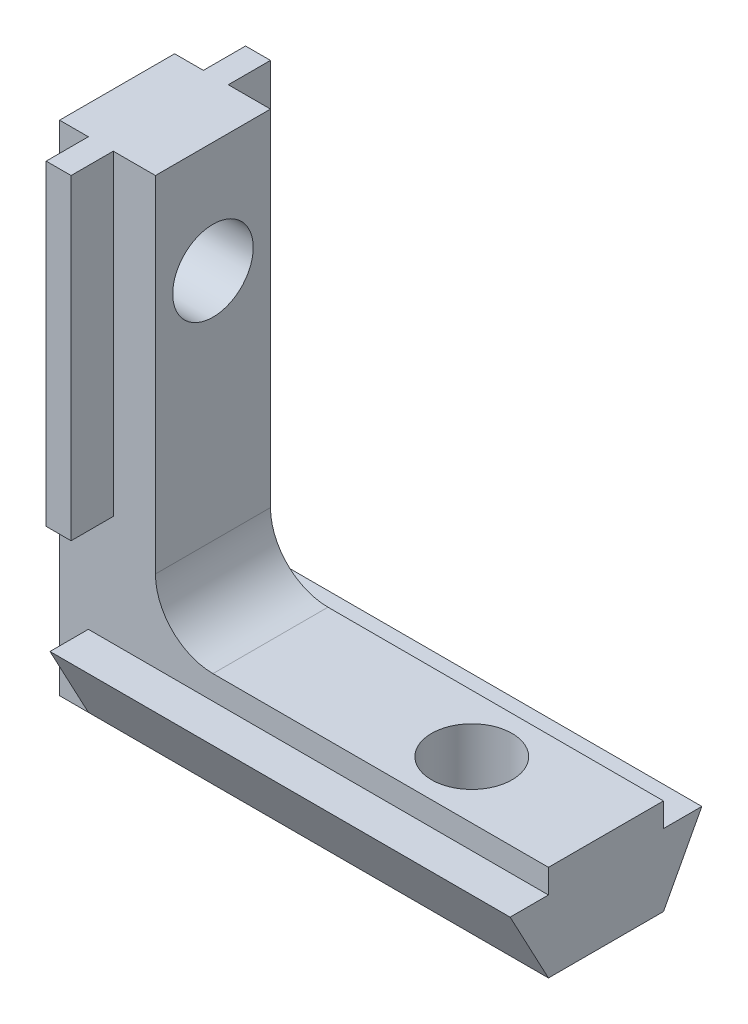
ISO-10303-21;
HEADER;
FILE_DESCRIPTION(('STEP AP214'),'2;1');
FILE_NAME('part.step','',(''),(''),'','','');
FILE_SCHEMA(('AUTOMOTIVE_DESIGN { 1 0 10303 214 1 1 1 1 }'));
ENDSEC;
DATA;
#1=APPLICATION_CONTEXT('core data for automotive mechanical design processes');
#2=APPLICATION_PROTOCOL_DEFINITION('international standard','automotive_design',2000,#1);
#3=PRODUCT_CONTEXT('',#1,'mechanical');
#4=PRODUCT('Part','Part','',(#3));
#5=PRODUCT_RELATED_PRODUCT_CATEGORY('part','',(#4));
#6=PRODUCT_DEFINITION_FORMATION('','',#4);
#7=PRODUCT_DEFINITION_CONTEXT('part definition',#1,'design');
#8=PRODUCT_DEFINITION('design','',#6,#7);
#9=PRODUCT_DEFINITION_SHAPE('','',#8);
#10=(LENGTH_UNIT() NAMED_UNIT(*) SI_UNIT(.MILLI.,.METRE.));
#11=(NAMED_UNIT(*) PLANE_ANGLE_UNIT() SI_UNIT($,.RADIAN.));
#12=(NAMED_UNIT(*) SI_UNIT($,.STERADIAN.) SOLID_ANGLE_UNIT());
#13=UNCERTAINTY_MEASURE_WITH_UNIT(LENGTH_MEASURE(1.E-05),#10,'distance_accuracy_value','');
#14=(GEOMETRIC_REPRESENTATION_CONTEXT(3) GLOBAL_UNCERTAINTY_ASSIGNED_CONTEXT((#13)) GLOBAL_UNIT_ASSIGNED_CONTEXT((#10,
#11,#12)) REPRESENTATION_CONTEXT('',''));
#15=CARTESIAN_POINT('',(0.,0.,0.));
#16=DIRECTION('',(0.,0.,1.));
#17=DIRECTION('',(1.,0.,0.));
#18=AXIS2_PLACEMENT_3D('',#15,#16,#17);
#19=CARTESIAN_POINT('',(5.,26.,3.));
#20=DIRECTION('',(0.,-1.,0.));
#21=DIRECTION('',(0.,0.,-1.));
#22=AXIS2_PLACEMENT_3D('',#19,#20,#21);
#23=PLANE('',#22);
#24=DIRECTION('',(-1.,0.,0.));
#25=VECTOR('',#24,1.);
#26=CARTESIAN_POINT('',(5.,26.,-3.));
#27=LINE('',#26,#25);
#28=CARTESIAN_POINT('',(5.,26.,-3.));
#29=VERTEX_POINT('',#28);
#30=CARTESIAN_POINT('',(2.8,26.,-3.));
#31=VERTEX_POINT('',#30);
#32=EDGE_CURVE('E277',#29,#31,#27,.T.);
#33=ORIENTED_EDGE('',*,*,#32,.T.);
#34=DIRECTION('',(0.,0.,-1.));
#35=VECTOR('',#34,1.);
#36=CARTESIAN_POINT('',(2.8,26.,-5.2));
#37=LINE('',#36,#35);
#38=CARTESIAN_POINT('',(2.8,26.,-5.2));
#39=VERTEX_POINT('',#38);
#40=EDGE_CURVE('E208',#31,#39,#37,.T.);
#41=ORIENTED_EDGE('',*,*,#40,.T.);
#42=DIRECTION('',(-1.,0.,0.));
#43=VECTOR('',#42,1.);
#44=CARTESIAN_POINT('',(1.5,26.,-5.2));
#45=LINE('',#44,#43);
#46=CARTESIAN_POINT('',(1.5,26.,-5.2));
#47=VERTEX_POINT('',#46);
#48=EDGE_CURVE('E181',#39,#47,#45,.T.);
#49=ORIENTED_EDGE('',*,*,#48,.T.);
#50=DIRECTION('',(0.,0.,1.));
#51=VECTOR('',#50,1.);
#52=CARTESIAN_POINT('',(1.5,26.,-5.2));
#53=LINE('',#52,#51);
#54=CARTESIAN_POINT('',(1.5,26.,-3.));
#55=VERTEX_POINT('',#54);
#56=EDGE_CURVE('E204',#47,#55,#53,.T.);
#57=ORIENTED_EDGE('',*,*,#56,.T.);
#58=CARTESIAN_POINT('',(0.,26.,-3.));
#59=VERTEX_POINT('',#58);
#60=EDGE_CURVE('E259',#55,#59,#27,.T.);
#61=ORIENTED_EDGE('',*,*,#60,.T.);
#62=DIRECTION('',(0.,0.,-1.));
#63=VECTOR('',#62,1.);
#64=CARTESIAN_POINT('',(0.,26.,3.));
#65=LINE('',#64,#63);
#66=CARTESIAN_POINT('',(0.,26.,3.));
#67=VERTEX_POINT('',#66);
#68=EDGE_CURVE('E310',#67,#59,#65,.T.);
#69=ORIENTED_EDGE('',*,*,#68,.F.);
#70=DIRECTION('',(-1.,0.,0.));
#71=VECTOR('',#70,1.);
#72=CARTESIAN_POINT('',(5.,26.,3.));
#73=LINE('',#72,#71);
#74=CARTESIAN_POINT('',(1.5,26.,3.));
#75=VERTEX_POINT('',#74);
#76=EDGE_CURVE('E263',#75,#67,#73,.T.);
#77=ORIENTED_EDGE('',*,*,#76,.F.);
#78=CARTESIAN_POINT('',(1.5,26.,5.2));
#79=VERTEX_POINT('',#78);
#80=EDGE_CURVE('E206',#75,#79,#53,.T.);
#81=ORIENTED_EDGE('',*,*,#80,.T.);
#82=DIRECTION('',(1.,0.,0.));
#83=VECTOR('',#82,1.);
#84=CARTESIAN_POINT('',(1.5,26.,5.2));
#85=LINE('',#84,#83);
#86=CARTESIAN_POINT('',(2.8,26.,5.2));
#87=VERTEX_POINT('',#86);
#88=EDGE_CURVE('E188',#79,#87,#85,.T.);
#89=ORIENTED_EDGE('',*,*,#88,.T.);
#90=CARTESIAN_POINT('',(2.8,26.,3.));
#91=VERTEX_POINT('',#90);
#92=EDGE_CURVE('E209',#87,#91,#37,.T.);
#93=ORIENTED_EDGE('',*,*,#92,.T.);
#94=CARTESIAN_POINT('',(5.,26.,3.));
#95=VERTEX_POINT('',#94);
#96=EDGE_CURVE('E260',#95,#91,#73,.T.);
#97=ORIENTED_EDGE('',*,*,#96,.F.);
#98=DIRECTION('',(0.,0.,-1.));
#99=VECTOR('',#98,1.);
#100=CARTESIAN_POINT('',(5.,26.,3.));
#101=LINE('',#100,#99);
#102=EDGE_CURVE('E276',#95,#29,#101,.T.);
#103=ORIENTED_EDGE('',*,*,#102,.T.);
#104=EDGE_LOOP('',(#33,#41,#49,#57,#61,#69,#77,#81,#89,#93,#97,#103));
#105=FACE_BOUND('',#104,.T.);
#106=ADVANCED_FACE('F36',(#105),#23,.F.);
#107=CARTESIAN_POINT('',(0.,26.,3.));
#108=DIRECTION('',(1.,0.,0.));
#109=DIRECTION('',(0.,1.,0.));
#110=AXIS2_PLACEMENT_3D('',#107,#108,#109);
#111=PLANE('',#110);
#112=CARTESIAN_POINT('',(0.,20.2,0.));
#113=DIRECTION('',(1.,0.,0.));
#114=DIRECTION('',(0.,0.,-1.));
#115=AXIS2_PLACEMENT_3D('',#112,#113,#114);
#116=CIRCLE('',#115,2.1);
#117=CARTESIAN_POINT('',(0.,20.2,-2.1));
#118=VERTEX_POINT('',#117);
#119=EDGE_CURVE('E402',#118,#118,#116,.T.);
#120=ORIENTED_EDGE('',*,*,#119,.T.);
#121=EDGE_LOOP('',(#120));
#122=FACE_BOUND('',#121,.T.);
#123=DIRECTION('',(0.,-1.,0.));
#124=VECTOR('',#123,1.);
#125=CARTESIAN_POINT('',(0.,26.,-3.));
#126=LINE('',#125,#124);
#127=CARTESIAN_POINT('',(0.,0.,-3.));
#128=VERTEX_POINT('',#127);
#129=EDGE_CURVE('E280',#59,#128,#126,.T.);
#130=ORIENTED_EDGE('',*,*,#129,.T.);
#131=DIRECTION('',(0.,0.,-1.));
#132=VECTOR('',#131,1.);
#133=CARTESIAN_POINT('',(0.,0.,3.));
#134=LINE('',#133,#132);
#135=CARTESIAN_POINT('',(0.,0.,3.));
#136=VERTEX_POINT('',#135);
#137=EDGE_CURVE('E307',#136,#128,#134,.T.);
#138=ORIENTED_EDGE('',*,*,#137,.F.);
#139=DIRECTION('',(0.,-1.,0.));
#140=VECTOR('',#139,1.);
#141=CARTESIAN_POINT('',(0.,26.,3.));
#142=LINE('',#141,#140);
#143=EDGE_CURVE('E262',#67,#136,#142,.T.);
#144=ORIENTED_EDGE('',*,*,#143,.F.);
#145=ORIENTED_EDGE('',*,*,#68,.T.);
#146=EDGE_LOOP('',(#130,#138,#144,#145));
#147=FACE_BOUND('',#146,.T.);
#148=ADVANCED_FACE('F423',(#122,#147),#111,.F.);
#149=CARTESIAN_POINT('',(0.,0.,3.));
#150=DIRECTION('',(0.,1.,0.));
#151=DIRECTION('',(0.,0.,1.));
#152=AXIS2_PLACEMENT_3D('',#149,#150,#151);
#153=PLANE('',#152);
#154=CARTESIAN_POINT('',(18.5,0.,0.));
#155=DIRECTION('',(0.,1.,0.));
#156=DIRECTION('',(0.,0.,1.));
#157=AXIS2_PLACEMENT_3D('',#154,#155,#156);
#158=CIRCLE('',#157,2.1);
#159=CARTESIAN_POINT('',(18.5,0.,2.1));
#160=VERTEX_POINT('',#159);
#161=EDGE_CURVE('E396',#160,#160,#158,.T.);
#162=ORIENTED_EDGE('',*,*,#161,.T.);
#163=EDGE_LOOP('',(#162));
#164=FACE_BOUND('',#163,.T.);
#165=DIRECTION('',(1.,0.,0.));
#166=VECTOR('',#165,1.);
#167=CARTESIAN_POINT('',(1.5,0.,3.));
#168=LINE('',#167,#166);
#169=CARTESIAN_POINT('',(1.49999999999999,0.,3.));
#170=VERTEX_POINT('',#169);
#171=CARTESIAN_POINT('',(25.5,0.,3.));
#172=VERTEX_POINT('',#171);
#173=EDGE_CURVE('E243',#170,#172,#168,.T.);
#174=ORIENTED_EDGE('',*,*,#173,.F.);
#175=DIRECTION('',(1.,0.,0.));
#176=VECTOR('',#175,1.);
#177=CARTESIAN_POINT('',(0.,0.,3.));
#178=LINE('',#177,#176);
#179=EDGE_CURVE('E265',#136,#170,#178,.T.);
#180=ORIENTED_EDGE('',*,*,#179,.F.);
#181=ORIENTED_EDGE('',*,*,#137,.T.);
#182=DIRECTION('',(1.,0.,0.));
#183=VECTOR('',#182,1.);
#184=CARTESIAN_POINT('',(0.,0.,-3.));
#185=LINE('',#184,#183);
#186=CARTESIAN_POINT('',(1.5,0.,-3.));
#187=VERTEX_POINT('',#186);
#188=EDGE_CURVE('E282',#128,#187,#185,.T.);
#189=ORIENTED_EDGE('',*,*,#188,.T.);
#190=DIRECTION('',(1.,0.,0.));
#191=VECTOR('',#190,1.);
#192=CARTESIAN_POINT('',(1.5,0.,-3.));
#193=LINE('',#192,#191);
#194=CARTESIAN_POINT('',(25.5,0.,-3.));
#195=VERTEX_POINT('',#194);
#196=EDGE_CURVE('E235',#187,#195,#193,.T.);
#197=ORIENTED_EDGE('',*,*,#196,.T.);
#198=DIRECTION('',(0.,0.,-1.));
#199=VECTOR('',#198,1.);
#200=CARTESIAN_POINT('',(25.5,0.,3.));
#201=LINE('',#200,#199);
#202=EDGE_CURVE('E304',#172,#195,#201,.T.);
#203=ORIENTED_EDGE('',*,*,#202,.F.);
#204=EDGE_LOOP('',(#174,#180,#181,#189,#197,#203));
#205=FACE_BOUND('',#204,.T.);
#206=ADVANCED_FACE('F374',(#164,#205),#153,.F.);
#207=CARTESIAN_POINT('',(25.5,0.,3.));
#208=DIRECTION('',(-1.,0.,0.));
#209=DIRECTION('',(0.,0.,1.));
#210=AXIS2_PLACEMENT_3D('',#207,#208,#209);
#211=PLANE('',#210);
#212=DIRECTION('',(0.,1.,0.));
#213=VECTOR('',#212,1.);
#214=CARTESIAN_POINT('',(25.5,0.,3.));
#215=LINE('',#214,#213);
#216=CARTESIAN_POINT('',(25.5,3.75,3.));
#217=VERTEX_POINT('',#216);
#218=CARTESIAN_POINT('',(25.5,5.,3.));
#219=VERTEX_POINT('',#218);
#220=EDGE_CURVE('E268',#217,#219,#215,.T.);
#221=ORIENTED_EDGE('',*,*,#220,.F.);
#222=DIRECTION('',(0.,0.,1.));
#223=VECTOR('',#222,1.);
#224=CARTESIAN_POINT('',(25.5,3.75,5.));
#225=LINE('',#224,#223);
#226=CARTESIAN_POINT('',(25.5,3.75,5.));
#227=VERTEX_POINT('',#226);
#228=EDGE_CURVE('E238',#217,#227,#225,.T.);
#229=ORIENTED_EDGE('',*,*,#228,.T.);
#230=DIRECTION('',(0.,-0.882352941176471,-0.470588235294118));
#231=VECTOR('',#230,1.);
#232=CARTESIAN_POINT('',(25.5,0.,3.));
#233=LINE('',#232,#231);
#234=EDGE_CURVE('E228',#227,#172,#233,.T.);
#235=ORIENTED_EDGE('',*,*,#234,.T.);
#236=ORIENTED_EDGE('',*,*,#202,.T.);
#237=DIRECTION('',(0.,0.882352941176471,-0.470588235294118));
#238=VECTOR('',#237,1.);
#239=CARTESIAN_POINT('',(25.5,0.,-3.));
#240=LINE('',#239,#238);
#241=CARTESIAN_POINT('',(25.5,3.75,-5.));
#242=VERTEX_POINT('',#241);
#243=EDGE_CURVE('E223',#195,#242,#240,.T.);
#244=ORIENTED_EDGE('',*,*,#243,.T.);
#245=CARTESIAN_POINT('',(25.5,3.75,-3.));
#246=VERTEX_POINT('',#245);
#247=EDGE_CURVE('E239',#242,#246,#225,.T.);
#248=ORIENTED_EDGE('',*,*,#247,.T.);
#249=DIRECTION('',(0.,1.,0.));
#250=VECTOR('',#249,1.);
#251=CARTESIAN_POINT('',(25.5,0.,-3.));
#252=LINE('',#251,#250);
#253=CARTESIAN_POINT('',(25.5,5.,-3.));
#254=VERTEX_POINT('',#253);
#255=EDGE_CURVE('E285',#246,#254,#252,.T.);
#256=ORIENTED_EDGE('',*,*,#255,.T.);
#257=DIRECTION('',(0.,0.,-1.));
#258=VECTOR('',#257,1.);
#259=CARTESIAN_POINT('',(25.5,5.,3.));
#260=LINE('',#259,#258);
#261=EDGE_CURVE('E301',#219,#254,#260,.T.);
#262=ORIENTED_EDGE('',*,*,#261,.F.);
#263=EDGE_LOOP('',(#221,#229,#235,#236,#244,#248,#256,#262));
#264=FACE_BOUND('',#263,.T.);
#265=ADVANCED_FACE('F363',(#264),#211,.F.);
#266=CARTESIAN_POINT('',(25.5,5.,3.));
#267=DIRECTION('',(0.,-1.,0.));
#268=DIRECTION('',(1.,0.,0.));
#269=AXIS2_PLACEMENT_3D('',#266,#267,#268);
#270=PLANE('',#269);
#271=CARTESIAN_POINT('',(18.5,5.,0.));
#272=DIRECTION('',(0.,1.,0.));
#273=DIRECTION('',(0.,0.,1.));
#274=AXIS2_PLACEMENT_3D('',#271,#272,#273);
#275=CIRCLE('',#274,2.1);
#276=CARTESIAN_POINT('',(18.5,5.,2.1));
#277=VERTEX_POINT('',#276);
#278=EDGE_CURVE('E398',#277,#277,#275,.T.);
#279=ORIENTED_EDGE('',*,*,#278,.F.);
#280=EDGE_LOOP('',(#279));
#281=FACE_BOUND('',#280,.T.);
#282=DIRECTION('',(-1.,0.,0.));
#283=VECTOR('',#282,1.);
#284=CARTESIAN_POINT('',(25.5,5.,-3.));
#285=LINE('',#284,#283);
#286=CARTESIAN_POINT('',(8.00000000000002,5.,-3.));
#287=VERTEX_POINT('',#286);
#288=EDGE_CURVE('E287',#254,#287,#285,.T.);
#289=ORIENTED_EDGE('',*,*,#288,.T.);
#290=DIRECTION('',(0.,0.,-1.));
#291=VECTOR('',#290,1.);
#292=CARTESIAN_POINT('',(8.00000000000002,5.,3.));
#293=LINE('',#292,#291);
#294=CARTESIAN_POINT('',(8.00000000000002,5.,3.));
#295=VERTEX_POINT('',#294);
#296=EDGE_CURVE('E298',#295,#287,#293,.T.);
#297=ORIENTED_EDGE('',*,*,#296,.F.);
#298=DIRECTION('',(-1.,0.,0.));
#299=VECTOR('',#298,1.);
#300=CARTESIAN_POINT('',(25.5,5.,3.));
#301=LINE('',#300,#299);
#302=EDGE_CURVE('E270',#219,#295,#301,.T.);
#303=ORIENTED_EDGE('',*,*,#302,.F.);
#304=ORIENTED_EDGE('',*,*,#261,.T.);
#305=EDGE_LOOP('',(#289,#297,#303,#304));
#306=FACE_BOUND('',#305,.T.);
#307=ADVANCED_FACE('F358',(#281,#306),#270,.F.);
#308=CARTESIAN_POINT('',(8.,8.,3.));
#309=DIRECTION('',(0.,0.,-1.));
#310=DIRECTION('',(-1.,0.,0.));
#311=AXIS2_PLACEMENT_3D('',#308,#309,#310);
#312=CYLINDRICAL_SURFACE('',#311,3.);
#313=CARTESIAN_POINT('',(8.,8.,-3.));
#314=DIRECTION('',(0.,0.,-1.));
#315=DIRECTION('',(-1.,0.,0.));
#316=AXIS2_PLACEMENT_3D('',#313,#314,#315);
#317=CIRCLE('',#316,3.);
#318=CARTESIAN_POINT('',(5.,8.00000000000002,-3.));
#319=VERTEX_POINT('',#318);
#320=EDGE_CURVE('E289',#287,#319,#317,.T.);
#321=ORIENTED_EDGE('',*,*,#320,.T.);
#322=DIRECTION('',(0.,0.,-1.));
#323=VECTOR('',#322,1.);
#324=CARTESIAN_POINT('',(5.,8.00000000000002,3.));
#325=LINE('',#324,#323);
#326=CARTESIAN_POINT('',(5.,8.00000000000002,3.));
#327=VERTEX_POINT('',#326);
#328=EDGE_CURVE('E295',#327,#319,#325,.T.);
#329=ORIENTED_EDGE('',*,*,#328,.F.);
#330=CARTESIAN_POINT('',(8.,8.,3.));
#331=DIRECTION('',(0.,0.,-1.));
#332=DIRECTION('',(-1.,0.,0.));
#333=AXIS2_PLACEMENT_3D('',#330,#331,#332);
#334=CIRCLE('',#333,3.);
#335=EDGE_CURVE('E272',#295,#327,#334,.T.);
#336=ORIENTED_EDGE('',*,*,#335,.F.);
#337=ORIENTED_EDGE('',*,*,#296,.T.);
#338=EDGE_LOOP('',(#321,#329,#336,#337));
#339=FACE_BOUND('',#338,.T.);
#340=ADVANCED_FACE('F354',(#339),#312,.F.);
#341=CARTESIAN_POINT('',(5.,8.00000000000002,3.));
#342=DIRECTION('',(-1.,0.,0.));
#343=DIRECTION('',(0.,-1.,0.));
#344=AXIS2_PLACEMENT_3D('',#341,#342,#343);
#345=PLANE('',#344);
#346=CARTESIAN_POINT('',(5.,20.2,0.));
#347=DIRECTION('',(1.,0.,0.));
#348=DIRECTION('',(0.,0.,-1.));
#349=AXIS2_PLACEMENT_3D('',#346,#347,#348);
#350=CIRCLE('',#349,2.09999999999999);
#351=CARTESIAN_POINT('',(5.,20.2,-2.09999999999999));
#352=VERTEX_POINT('',#351);
#353=EDGE_CURVE('E407',#352,#352,#350,.T.);
#354=ORIENTED_EDGE('',*,*,#353,.F.);
#355=EDGE_LOOP('',(#354));
#356=FACE_BOUND('',#355,.T.);
#357=DIRECTION('',(0.,1.,0.));
#358=VECTOR('',#357,1.);
#359=CARTESIAN_POINT('',(5.,8.00000000000002,-3.));
#360=LINE('',#359,#358);
#361=EDGE_CURVE('E291',#319,#29,#360,.T.);
#362=ORIENTED_EDGE('',*,*,#361,.T.);
#363=ORIENTED_EDGE('',*,*,#102,.F.);
#364=DIRECTION('',(0.,1.,0.));
#365=VECTOR('',#364,1.);
#366=CARTESIAN_POINT('',(5.,8.00000000000002,3.));
#367=LINE('',#366,#365);
#368=EDGE_CURVE('E274',#327,#95,#367,.T.);
#369=ORIENTED_EDGE('',*,*,#368,.F.);
#370=ORIENTED_EDGE('',*,*,#328,.T.);
#371=EDGE_LOOP('',(#362,#363,#369,#370));
#372=FACE_BOUND('',#371,.T.);
#373=ADVANCED_FACE('F349',(#356,#372),#345,.F.);
#374=CARTESIAN_POINT('',(8.,8.,3.));
#375=DIRECTION('',(0.,0.,-1.));
#376=DIRECTION('',(-1.,0.,0.));
#377=AXIS2_PLACEMENT_3D('',#374,#375,#376);
#378=PLANE('',#377);
#379=DIRECTION('',(1.,0.,0.));
#380=VECTOR('',#379,1.);
#381=CARTESIAN_POINT('',(8.,9.5,3.));
#382=LINE('',#381,#380);
#383=CARTESIAN_POINT('',(1.5,9.5,3.));
#384=VERTEX_POINT('',#383);
#385=CARTESIAN_POINT('',(2.8,9.5,3.));
#386=VERTEX_POINT('',#385);
#387=EDGE_CURVE('E54',#384,#386,#382,.T.);
#388=ORIENTED_EDGE('',*,*,#387,.F.);
#389=DIRECTION('',(0.,1.,0.));
#390=VECTOR('',#389,1.);
#391=CARTESIAN_POINT('',(1.5,8.,3.));
#392=LINE('',#391,#390);
#393=EDGE_CURVE('E177',#384,#75,#392,.T.);
#394=ORIENTED_EDGE('',*,*,#393,.T.);
#395=ORIENTED_EDGE('',*,*,#76,.T.);
#396=ORIENTED_EDGE('',*,*,#143,.T.);
#397=ORIENTED_EDGE('',*,*,#179,.T.);
#398=DIRECTION('',(0.,-1.,0.));
#399=VECTOR('',#398,1.);
#400=CARTESIAN_POINT('',(1.49999999999999,8.,3.));
#401=LINE('',#400,#399);
#402=CARTESIAN_POINT('',(1.49999999999999,3.75,3.));
#403=VERTEX_POINT('',#402);
#404=EDGE_CURVE('E246',#403,#170,#401,.T.);
#405=ORIENTED_EDGE('',*,*,#404,.F.);
#406=DIRECTION('',(1.,0.,0.));
#407=VECTOR('',#406,1.);
#408=CARTESIAN_POINT('',(8.,3.75,3.));
#409=LINE('',#408,#407);
#410=EDGE_CURVE('E256',#403,#217,#409,.T.);
#411=ORIENTED_EDGE('',*,*,#410,.T.);
#412=ORIENTED_EDGE('',*,*,#220,.T.);
#413=ORIENTED_EDGE('',*,*,#302,.T.);
#414=ORIENTED_EDGE('',*,*,#335,.T.);
#415=ORIENTED_EDGE('',*,*,#368,.T.);
#416=ORIENTED_EDGE('',*,*,#96,.T.);
#417=DIRECTION('',(0.,-1.,0.));
#418=VECTOR('',#417,1.);
#419=CARTESIAN_POINT('',(2.8,8.,3.));
#420=LINE('',#419,#418);
#421=EDGE_CURVE('E50',#91,#386,#420,.T.);
#422=ORIENTED_EDGE('',*,*,#421,.T.);
#423=EDGE_LOOP('',(#388,#394,#395,#396,#397,#405,#411,#412,#413,#414,#415,#416,#422));
#424=FACE_BOUND('',#423,.T.);
#425=ADVANCED_FACE('F383',(#424),#378,.F.);
#426=CARTESIAN_POINT('',(8.,8.,-3.));
#427=DIRECTION('',(0.,0.,-1.));
#428=DIRECTION('',(-1.,0.,0.));
#429=AXIS2_PLACEMENT_3D('',#426,#427,#428);
#430=PLANE('',#429);
#431=DIRECTION('',(0.,1.,0.));
#432=VECTOR('',#431,1.);
#433=CARTESIAN_POINT('',(1.5,8.,-3.));
#434=LINE('',#433,#432);
#435=CARTESIAN_POINT('',(1.5,9.5,-3.));
#436=VERTEX_POINT('',#435);
#437=EDGE_CURVE('E11',#436,#55,#434,.T.);
#438=ORIENTED_EDGE('',*,*,#437,.F.);
#439=DIRECTION('',(1.,0.,0.));
#440=VECTOR('',#439,1.);
#441=CARTESIAN_POINT('',(8.,9.5,-3.));
#442=LINE('',#441,#440);
#443=CARTESIAN_POINT('',(2.8,9.5,-3.));
#444=VERTEX_POINT('',#443);
#445=EDGE_CURVE('E319',#436,#444,#442,.T.);
#446=ORIENTED_EDGE('',*,*,#445,.T.);
#447=DIRECTION('',(0.,-1.,0.));
#448=VECTOR('',#447,1.);
#449=CARTESIAN_POINT('',(2.8,8.,-3.));
#450=LINE('',#449,#448);
#451=EDGE_CURVE('E43',#31,#444,#450,.T.);
#452=ORIENTED_EDGE('',*,*,#451,.F.);
#453=ORIENTED_EDGE('',*,*,#32,.F.);
#454=ORIENTED_EDGE('',*,*,#361,.F.);
#455=ORIENTED_EDGE('',*,*,#320,.F.);
#456=ORIENTED_EDGE('',*,*,#288,.F.);
#457=ORIENTED_EDGE('',*,*,#255,.F.);
#458=DIRECTION('',(1.,0.,0.));
#459=VECTOR('',#458,1.);
#460=CARTESIAN_POINT('',(8.,3.75,-3.));
#461=LINE('',#460,#459);
#462=CARTESIAN_POINT('',(1.5,3.75,-3.));
#463=VERTEX_POINT('',#462);
#464=EDGE_CURVE('E316',#463,#246,#461,.T.);
#465=ORIENTED_EDGE('',*,*,#464,.F.);
#466=DIRECTION('',(0.,-1.,0.));
#467=VECTOR('',#466,1.);
#468=CARTESIAN_POINT('',(1.49999999999999,8.,-3.));
#469=LINE('',#468,#467);
#470=EDGE_CURVE('E313',#463,#187,#469,.T.);
#471=ORIENTED_EDGE('',*,*,#470,.T.);
#472=ORIENTED_EDGE('',*,*,#188,.F.);
#473=ORIENTED_EDGE('',*,*,#129,.F.);
#474=ORIENTED_EDGE('',*,*,#60,.F.);
#475=EDGE_LOOP('',(#438,#446,#452,#453,#454,#455,#456,#457,#465,#471,#472,#473,#474));
#476=FACE_BOUND('',#475,.T.);
#477=ADVANCED_FACE('F333',(#476),#430,.T.);
#478=CARTESIAN_POINT('',(1.49999999999999,0.,0.));
#479=DIRECTION('',(1.,0.,0.));
#480=DIRECTION('',(0.,0.,-1.));
#481=AXIS2_PLACEMENT_3D('',#478,#479,#480);
#482=PLANE('',#481);
#483=ORIENTED_EDGE('',*,*,#470,.F.);
#484=DIRECTION('',(0.,0.,1.));
#485=VECTOR('',#484,1.);
#486=CARTESIAN_POINT('',(1.5,3.75,5.));
#487=LINE('',#486,#485);
#488=CARTESIAN_POINT('',(1.5,3.75,-5.));
#489=VERTEX_POINT('',#488);
#490=EDGE_CURVE('E229',#489,#463,#487,.T.);
#491=ORIENTED_EDGE('',*,*,#490,.F.);
#492=DIRECTION('',(0.,0.882352941176471,-0.470588235294118));
#493=VECTOR('',#492,1.);
#494=CARTESIAN_POINT('',(1.5,0.,-3.));
#495=LINE('',#494,#493);
#496=EDGE_CURVE('E224',#187,#489,#495,.T.);
#497=ORIENTED_EDGE('',*,*,#496,.F.);
#498=EDGE_LOOP('',(#483,#491,#497));
#499=FACE_BOUND('',#498,.T.);
#500=ADVANCED_FACE('F370',(#499),#482,.F.);
#501=CARTESIAN_POINT('',(1.5,0.,-3.));
#502=DIRECTION('',(0.,-0.470588235294118,-0.882352941176471));
#503=DIRECTION('',(0.,0.882352941176471,-0.470588235294118));
#504=AXIS2_PLACEMENT_3D('',#501,#502,#503);
#505=PLANE('',#504);
#506=ORIENTED_EDGE('',*,*,#243,.F.);
#507=ORIENTED_EDGE('',*,*,#196,.F.);
#508=ORIENTED_EDGE('',*,*,#496,.T.);
#509=DIRECTION('',(1.,0.,0.));
#510=VECTOR('',#509,1.);
#511=CARTESIAN_POINT('',(1.5,3.75,-5.));
#512=LINE('',#511,#510);
#513=EDGE_CURVE('E250',#489,#242,#512,.T.);
#514=ORIENTED_EDGE('',*,*,#513,.T.);
#515=EDGE_LOOP('',(#506,#507,#508,#514));
#516=FACE_BOUND('',#515,.T.);
#517=ADVANCED_FACE('F372',(#516),#505,.T.);
#518=CARTESIAN_POINT('',(1.5,3.75,5.));
#519=DIRECTION('',(0.,1.,0.));
#520=DIRECTION('',(0.,0.,1.));
#521=AXIS2_PLACEMENT_3D('',#518,#519,#520);
#522=PLANE('',#521);
#523=ORIENTED_EDGE('',*,*,#490,.T.);
#524=ORIENTED_EDGE('',*,*,#464,.T.);
#525=ORIENTED_EDGE('',*,*,#247,.F.);
#526=ORIENTED_EDGE('',*,*,#513,.F.);
#527=EDGE_LOOP('',(#523,#524,#525,#526));
#528=FACE_BOUND('',#527,.T.);
#529=ADVANCED_FACE('F366',(#528),#522,.T.);
#530=ORIENTED_EDGE('',*,*,#410,.F.);
#531=CARTESIAN_POINT('',(1.5,3.75,5.));
#532=VERTEX_POINT('',#531);
#533=EDGE_CURVE('E227',#403,#532,#487,.T.);
#534=ORIENTED_EDGE('',*,*,#533,.T.);
#535=DIRECTION('',(1.,0.,0.));
#536=VECTOR('',#535,1.);
#537=CARTESIAN_POINT('',(1.5,3.75,5.));
#538=LINE('',#537,#536);
#539=EDGE_CURVE('E247',#532,#227,#538,.T.);
#540=ORIENTED_EDGE('',*,*,#539,.T.);
#541=ORIENTED_EDGE('',*,*,#228,.F.);
#542=EDGE_LOOP('',(#530,#534,#540,#541));
#543=FACE_BOUND('',#542,.T.);
#544=ADVANCED_FACE('F391',(#543),#522,.T.);
#545=ORIENTED_EDGE('',*,*,#533,.F.);
#546=ORIENTED_EDGE('',*,*,#404,.T.);
#547=DIRECTION('',(0.,-0.882352941176471,-0.470588235294118));
#548=VECTOR('',#547,1.);
#549=CARTESIAN_POINT('',(1.5,0.,3.));
#550=LINE('',#549,#548);
#551=EDGE_CURVE('E232',#532,#170,#550,.T.);
#552=ORIENTED_EDGE('',*,*,#551,.F.);
#553=EDGE_LOOP('',(#545,#546,#552));
#554=FACE_BOUND('',#553,.T.);
#555=ADVANCED_FACE('F389',(#554),#482,.F.);
#556=CARTESIAN_POINT('',(1.5,0.,3.));
#557=DIRECTION('',(0.,-0.470588235294118,0.88235294117647));
#558=DIRECTION('',(0.,-0.882352941176471,-0.470588235294118));
#559=AXIS2_PLACEMENT_3D('',#556,#557,#558);
#560=PLANE('',#559);
#561=ORIENTED_EDGE('',*,*,#234,.F.);
#562=ORIENTED_EDGE('',*,*,#539,.F.);
#563=ORIENTED_EDGE('',*,*,#551,.T.);
#564=ORIENTED_EDGE('',*,*,#173,.T.);
#565=EDGE_LOOP('',(#561,#562,#563,#564));
#566=FACE_BOUND('',#565,.T.);
#567=ADVANCED_FACE('F380',(#566),#560,.T.);
#568=CARTESIAN_POINT('',(1.5,9.5,-5.2));
#569=DIRECTION('',(0.,0.,-1.));
#570=DIRECTION('',(-1.,0.,0.));
#571=AXIS2_PLACEMENT_3D('',#568,#569,#570);
#572=PLANE('',#571);
#573=ORIENTED_EDGE('',*,*,#48,.F.);
#574=DIRECTION('',(0.,1.,0.));
#575=VECTOR('',#574,1.);
#576=CARTESIAN_POINT('',(2.8,9.5,-5.2));
#577=LINE('',#576,#575);
#578=CARTESIAN_POINT('',(2.8,9.5,-5.2));
#579=VERTEX_POINT('',#578);
#580=EDGE_CURVE('E216',#579,#39,#577,.T.);
#581=ORIENTED_EDGE('',*,*,#580,.F.);
#582=DIRECTION('',(-1.,0.,0.));
#583=VECTOR('',#582,1.);
#584=CARTESIAN_POINT('',(1.5,9.5,-5.2));
#585=LINE('',#584,#583);
#586=CARTESIAN_POINT('',(1.5,9.5,-5.2));
#587=VERTEX_POINT('',#586);
#588=EDGE_CURVE('E190',#579,#587,#585,.T.);
#589=ORIENTED_EDGE('',*,*,#588,.T.);
#590=DIRECTION('',(0.,1.,0.));
#591=VECTOR('',#590,1.);
#592=CARTESIAN_POINT('',(1.5,9.5,-5.2));
#593=LINE('',#592,#591);
#594=EDGE_CURVE('E214',#587,#47,#593,.T.);
#595=ORIENTED_EDGE('',*,*,#594,.T.);
#596=EDGE_LOOP('',(#573,#581,#589,#595));
#597=FACE_BOUND('',#596,.T.);
#598=ADVANCED_FACE('F341',(#597),#572,.T.);
#599=CARTESIAN_POINT('',(0.,9.5,0.));
#600=DIRECTION('',(0.,1.,0.));
#601=DIRECTION('',(0.,0.,1.));
#602=AXIS2_PLACEMENT_3D('',#599,#600,#601);
#603=PLANE('',#602);
#604=ORIENTED_EDGE('',*,*,#445,.F.);
#605=DIRECTION('',(0.,0.,1.));
#606=VECTOR('',#605,1.);
#607=CARTESIAN_POINT('',(1.5,9.5,-5.2));
#608=LINE('',#607,#606);
#609=EDGE_CURVE('E180',#587,#436,#608,.T.);
#610=ORIENTED_EDGE('',*,*,#609,.F.);
#611=ORIENTED_EDGE('',*,*,#588,.F.);
#612=DIRECTION('',(0.,0.,-1.));
#613=VECTOR('',#612,1.);
#614=CARTESIAN_POINT('',(2.8,9.5,-5.2));
#615=LINE('',#614,#613);
#616=EDGE_CURVE('E196',#444,#579,#615,.T.);
#617=ORIENTED_EDGE('',*,*,#616,.F.);
#618=EDGE_LOOP('',(#604,#610,#611,#617));
#619=FACE_BOUND('',#618,.T.);
#620=ADVANCED_FACE('F330',(#619),#603,.F.);
#621=CARTESIAN_POINT('',(2.8,9.5,-5.2));
#622=DIRECTION('',(1.,0.,0.));
#623=DIRECTION('',(0.,0.,-1.));
#624=AXIS2_PLACEMENT_3D('',#621,#622,#623);
#625=PLANE('',#624);
#626=ORIENTED_EDGE('',*,*,#40,.F.);
#627=ORIENTED_EDGE('',*,*,#451,.T.);
#628=ORIENTED_EDGE('',*,*,#616,.T.);
#629=ORIENTED_EDGE('',*,*,#580,.T.);
#630=EDGE_LOOP('',(#626,#627,#628,#629));
#631=FACE_BOUND('',#630,.T.);
#632=ADVANCED_FACE('F324',(#631),#625,.T.);
#633=CARTESIAN_POINT('',(1.5,9.5,-5.2));
#634=DIRECTION('',(-1.,0.,0.));
#635=DIRECTION('',(0.,0.,1.));
#636=AXIS2_PLACEMENT_3D('',#633,#634,#635);
#637=PLANE('',#636);
#638=ORIENTED_EDGE('',*,*,#609,.T.);
#639=ORIENTED_EDGE('',*,*,#437,.T.);
#640=ORIENTED_EDGE('',*,*,#56,.F.);
#641=ORIENTED_EDGE('',*,*,#594,.F.);
#642=EDGE_LOOP('',(#638,#639,#640,#641));
#643=FACE_BOUND('',#642,.T.);
#644=ADVANCED_FACE('F338',(#643),#637,.T.);
#645=ORIENTED_EDGE('',*,*,#393,.F.);
#646=CARTESIAN_POINT('',(1.5,9.5,5.2));
#647=VERTEX_POINT('',#646);
#648=EDGE_CURVE('E171',#384,#647,#608,.T.);
#649=ORIENTED_EDGE('',*,*,#648,.T.);
#650=DIRECTION('',(0.,1.,0.));
#651=VECTOR('',#650,1.);
#652=CARTESIAN_POINT('',(1.5,9.5,5.2));
#653=LINE('',#652,#651);
#654=EDGE_CURVE('E175',#647,#79,#653,.T.);
#655=ORIENTED_EDGE('',*,*,#654,.T.);
#656=ORIENTED_EDGE('',*,*,#80,.F.);
#657=EDGE_LOOP('',(#645,#649,#655,#656));
#658=FACE_BOUND('',#657,.T.);
#659=ADVANCED_FACE('F173',(#658),#637,.T.);
#660=ORIENTED_EDGE('',*,*,#421,.F.);
#661=ORIENTED_EDGE('',*,*,#92,.F.);
#662=DIRECTION('',(0.,1.,0.));
#663=VECTOR('',#662,1.);
#664=CARTESIAN_POINT('',(2.8,9.5,5.2));
#665=LINE('',#664,#663);
#666=CARTESIAN_POINT('',(2.8,9.5,5.2));
#667=VERTEX_POINT('',#666);
#668=EDGE_CURVE('E189',#667,#87,#665,.T.);
#669=ORIENTED_EDGE('',*,*,#668,.F.);
#670=EDGE_CURVE('E195',#667,#386,#615,.T.);
#671=ORIENTED_EDGE('',*,*,#670,.T.);
#672=EDGE_LOOP('',(#660,#661,#669,#671));
#673=FACE_BOUND('',#672,.T.);
#674=ADVANCED_FACE('F394',(#673),#625,.T.);
#675=ORIENTED_EDGE('',*,*,#648,.F.);
#676=ORIENTED_EDGE('',*,*,#387,.T.);
#677=ORIENTED_EDGE('',*,*,#670,.F.);
#678=DIRECTION('',(1.,0.,0.));
#679=VECTOR('',#678,1.);
#680=CARTESIAN_POINT('',(1.5,9.5,5.2));
#681=LINE('',#680,#679);
#682=EDGE_CURVE('E186',#647,#667,#681,.T.);
#683=ORIENTED_EDGE('',*,*,#682,.F.);
#684=EDGE_LOOP('',(#675,#676,#677,#683));
#685=FACE_BOUND('',#684,.T.);
#686=ADVANCED_FACE('F193',(#685),#603,.F.);
#687=CARTESIAN_POINT('',(1.5,9.5,5.2));
#688=DIRECTION('',(0.,0.,1.));
#689=DIRECTION('',(1.,0.,0.));
#690=AXIS2_PLACEMENT_3D('',#687,#688,#689);
#691=PLANE('',#690);
#692=ORIENTED_EDGE('',*,*,#88,.F.);
#693=ORIENTED_EDGE('',*,*,#654,.F.);
#694=ORIENTED_EDGE('',*,*,#682,.T.);
#695=ORIENTED_EDGE('',*,*,#668,.T.);
#696=EDGE_LOOP('',(#692,#693,#694,#695));
#697=FACE_BOUND('',#696,.T.);
#698=ADVANCED_FACE('F185',(#697),#691,.T.);
#699=CARTESIAN_POINT('',(18.5,5.,0.));
#700=DIRECTION('',(0.,1.,0.));
#701=DIRECTION('',(0.,0.,1.));
#702=AXIS2_PLACEMENT_3D('',#699,#700,#701);
#703=CYLINDRICAL_SURFACE('',#702,2.1);
#704=ORIENTED_EDGE('',*,*,#161,.F.);
#705=EDGE_LOOP('',(#704));
#706=FACE_BOUND('',#705,.T.);
#707=ORIENTED_EDGE('',*,*,#278,.T.);
#708=EDGE_LOOP('',(#707));
#709=FACE_BOUND('',#708,.T.);
#710=ADVANCED_FACE('F442',(#706,#709),#703,.F.);
#711=CARTESIAN_POINT('',(5.,20.2,0.));
#712=DIRECTION('',(1.,0.,0.));
#713=DIRECTION('',(0.,0.,-1.));
#714=AXIS2_PLACEMENT_3D('',#711,#712,#713);
#715=CYLINDRICAL_SURFACE('',#714,2.09999999999999);
#716=ORIENTED_EDGE('',*,*,#119,.F.);
#717=EDGE_LOOP('',(#716));
#718=FACE_BOUND('',#717,.T.);
#719=ORIENTED_EDGE('',*,*,#353,.T.);
#720=EDGE_LOOP('',(#719));
#721=FACE_BOUND('',#720,.T.);
#722=ADVANCED_FACE('F411',(#718,#721),#715,.F.);
#723=CLOSED_SHELL('',(#106,#148,#206,#265,#307,#340,#373,#425,#477,#500,#517,#529,#544,#555,
#567,#598,#620,#632,#644,#659,#674,#686,#698,#710,#722));
#724=MANIFOLD_SOLID_BREP('B2',#723);
#725=ADVANCED_BREP_SHAPE_REPRESENTATION('',(#18,#724),#14);
#726=SHAPE_DEFINITION_REPRESENTATION(#9,#725);
ENDSEC;
END-ISO-10303-21;
